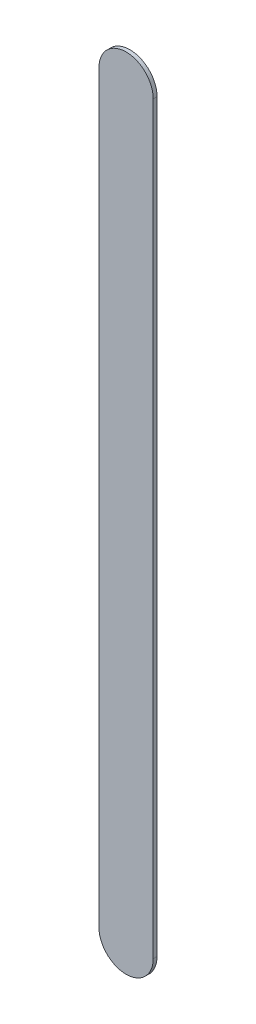
ISO-10303-21;
HEADER;
FILE_DESCRIPTION(('STEP AP214'),'2;1');
FILE_NAME('part.step','',(''),(''),'','','');
FILE_SCHEMA(('AUTOMOTIVE_DESIGN { 1 0 10303 214 1 1 1 1 }'));
ENDSEC;
DATA;
#1=APPLICATION_CONTEXT('core data for automotive mechanical design processes');
#2=APPLICATION_PROTOCOL_DEFINITION('international standard','automotive_design',2000,#1);
#3=PRODUCT_CONTEXT('',#1,'mechanical');
#4=PRODUCT('Part','Part','',(#3));
#5=PRODUCT_RELATED_PRODUCT_CATEGORY('part','',(#4));
#6=PRODUCT_DEFINITION_FORMATION('','',#4);
#7=PRODUCT_DEFINITION_CONTEXT('part definition',#1,'design');
#8=PRODUCT_DEFINITION('design','',#6,#7);
#9=PRODUCT_DEFINITION_SHAPE('','',#8);
#10=(LENGTH_UNIT() NAMED_UNIT(*) SI_UNIT(.MILLI.,.METRE.));
#11=(NAMED_UNIT(*) PLANE_ANGLE_UNIT() SI_UNIT($,.RADIAN.));
#12=(NAMED_UNIT(*) SI_UNIT($,.STERADIAN.) SOLID_ANGLE_UNIT());
#13=UNCERTAINTY_MEASURE_WITH_UNIT(LENGTH_MEASURE(1.E-05),#10,'distance_accuracy_value','');
#14=(GEOMETRIC_REPRESENTATION_CONTEXT(3) GLOBAL_UNCERTAINTY_ASSIGNED_CONTEXT((#13)) GLOBAL_UNIT_ASSIGNED_CONTEXT((#10,
#11,#12)) REPRESENTATION_CONTEXT('',''));
#15=CARTESIAN_POINT('',(0.,0.,0.));
#16=DIRECTION('',(0.,0.,1.));
#17=DIRECTION('',(1.,0.,0.));
#18=AXIS2_PLACEMENT_3D('',#15,#16,#17);
#19=CARTESIAN_POINT('',(163.572,-123.825,0.));
#20=DIRECTION('',(0.,0.,1.));
#21=DIRECTION('',(1.,0.,0.));
#22=AXIS2_PLACEMENT_3D('',#19,#20,#21);
#23=PLANE('',#22);
#24=DIRECTION('',(0.,1.,0.));
#25=VECTOR('',#24,1.);
#26=CARTESIAN_POINT('',(163.572,-123.825,0.));
#27=LINE('',#26,#25);
#28=CARTESIAN_POINT('',(163.572,-123.825,0.));
#29=VERTEX_POINT('',#28);
#30=CARTESIAN_POINT('',(163.572,-116.967,0.));
#31=VERTEX_POINT('',#30);
#32=EDGE_CURVE('E86',#29,#31,#27,.T.);
#33=ORIENTED_EDGE('',*,*,#32,.T.);
#34=CARTESIAN_POINT('',(163.322,-116.967,0.));
#35=DIRECTION('',(0.,0.,1.));
#36=DIRECTION('',(1.,0.,0.));
#37=AXIS2_PLACEMENT_3D('',#34,#35,#36);
#38=CIRCLE('',#37,0.25);
#39=CARTESIAN_POINT('',(163.072,-116.967,0.));
#40=VERTEX_POINT('',#39);
#41=EDGE_CURVE('E72',#31,#40,#38,.T.);
#42=ORIENTED_EDGE('',*,*,#41,.T.);
#43=DIRECTION('',(0.,-1.,0.));
#44=VECTOR('',#43,1.);
#45=CARTESIAN_POINT('',(163.072,-116.967,0.));
#46=LINE('',#45,#44);
#47=CARTESIAN_POINT('',(163.072,-123.825,0.));
#48=VERTEX_POINT('',#47);
#49=EDGE_CURVE('E107',#40,#48,#46,.T.);
#50=ORIENTED_EDGE('',*,*,#49,.T.);
#51=CARTESIAN_POINT('',(163.322,-123.825,0.));
#52=DIRECTION('',(0.,0.,1.));
#53=DIRECTION('',(-1.,0.,0.));
#54=AXIS2_PLACEMENT_3D('',#51,#52,#53);
#55=CIRCLE('',#54,0.25);
#56=EDGE_CURVE('E11',#48,#29,#55,.T.);
#57=ORIENTED_EDGE('',*,*,#56,.T.);
#58=EDGE_LOOP('',(#33,#42,#50,#57));
#59=FACE_BOUND('',#58,.T.);
#60=ADVANCED_FACE('F17',(#59),#23,.T.);
#61=CARTESIAN_POINT('',(163.572,-123.825,-0.035));
#62=DIRECTION('',(0.,0.,1.));
#63=DIRECTION('',(1.,0.,0.));
#64=AXIS2_PLACEMENT_3D('',#61,#62,#63);
#65=PLANE('',#64);
#66=CARTESIAN_POINT('',(163.322,-123.825,-0.035));
#67=DIRECTION('',(0.,0.,1.));
#68=DIRECTION('',(-1.,0.,0.));
#69=AXIS2_PLACEMENT_3D('',#66,#67,#68);
#70=CIRCLE('',#69,0.25);
#71=CARTESIAN_POINT('',(163.072,-123.825,-0.035));
#72=VERTEX_POINT('',#71);
#73=CARTESIAN_POINT('',(163.572,-123.825,-0.035));
#74=VERTEX_POINT('',#73);
#75=EDGE_CURVE('E21',#72,#74,#70,.T.);
#76=ORIENTED_EDGE('',*,*,#75,.F.);
#77=DIRECTION('',(0.,-1.,0.));
#78=VECTOR('',#77,1.);
#79=CARTESIAN_POINT('',(163.072,-116.967,-0.035));
#80=LINE('',#79,#78);
#81=CARTESIAN_POINT('',(163.072,-116.967,-0.035));
#82=VERTEX_POINT('',#81);
#83=EDGE_CURVE('E83',#82,#72,#80,.T.);
#84=ORIENTED_EDGE('',*,*,#83,.F.);
#85=CARTESIAN_POINT('',(163.322,-116.967,-0.035));
#86=DIRECTION('',(0.,0.,1.));
#87=DIRECTION('',(1.,0.,0.));
#88=AXIS2_PLACEMENT_3D('',#85,#86,#87);
#89=CIRCLE('',#88,0.25);
#90=CARTESIAN_POINT('',(163.572,-116.967,-0.035));
#91=VERTEX_POINT('',#90);
#92=EDGE_CURVE('E104',#91,#82,#89,.T.);
#93=ORIENTED_EDGE('',*,*,#92,.F.);
#94=DIRECTION('',(0.,1.,0.));
#95=VECTOR('',#94,1.);
#96=CARTESIAN_POINT('',(163.572,-123.825,-0.035));
#97=LINE('',#96,#95);
#98=EDGE_CURVE('E93',#74,#91,#97,.T.);
#99=ORIENTED_EDGE('',*,*,#98,.F.);
#100=EDGE_LOOP('',(#76,#84,#93,#99));
#101=FACE_BOUND('',#100,.T.);
#102=ADVANCED_FACE('F19',(#101),#65,.F.);
#103=CARTESIAN_POINT('',(163.322,-123.825,-0.035));
#104=DIRECTION('',(0.,0.,-1.));
#105=DIRECTION('',(-1.,0.,0.));
#106=AXIS2_PLACEMENT_3D('',#103,#104,#105);
#107=CYLINDRICAL_SURFACE('',#106,0.25);
#108=ORIENTED_EDGE('',*,*,#75,.T.);
#109=DIRECTION('',(0.,0.,1.));
#110=VECTOR('',#109,1.);
#111=CARTESIAN_POINT('',(163.572,-123.825,-0.035));
#112=LINE('',#111,#110);
#113=EDGE_CURVE('E90',#74,#29,#112,.T.);
#114=ORIENTED_EDGE('',*,*,#113,.T.);
#115=ORIENTED_EDGE('',*,*,#56,.F.);
#116=DIRECTION('',(0.,0.,1.));
#117=VECTOR('',#116,1.);
#118=CARTESIAN_POINT('',(163.072,-123.825,-0.035));
#119=LINE('',#118,#117);
#120=EDGE_CURVE('E109',#72,#48,#119,.T.);
#121=ORIENTED_EDGE('',*,*,#120,.F.);
#122=EDGE_LOOP('',(#108,#114,#115,#121));
#123=FACE_BOUND('',#122,.T.);
#124=ADVANCED_FACE('F126',(#123),#107,.T.);
#125=CARTESIAN_POINT('',(163.072,-116.967,-0.035));
#126=DIRECTION('',(1.,0.,0.));
#127=DIRECTION('',(0.,1.,0.));
#128=AXIS2_PLACEMENT_3D('',#125,#126,#127);
#129=PLANE('',#128);
#130=ORIENTED_EDGE('',*,*,#83,.T.);
#131=ORIENTED_EDGE('',*,*,#120,.T.);
#132=ORIENTED_EDGE('',*,*,#49,.F.);
#133=DIRECTION('',(0.,0.,1.));
#134=VECTOR('',#133,1.);
#135=CARTESIAN_POINT('',(163.072,-116.967,-0.035));
#136=LINE('',#135,#134);
#137=EDGE_CURVE('E80',#82,#40,#136,.T.);
#138=ORIENTED_EDGE('',*,*,#137,.F.);
#139=EDGE_LOOP('',(#130,#131,#132,#138));
#140=FACE_BOUND('',#139,.T.);
#141=ADVANCED_FACE('F124',(#140),#129,.F.);
#142=CARTESIAN_POINT('',(163.322,-116.967,-0.035));
#143=DIRECTION('',(0.,0.,-1.));
#144=DIRECTION('',(1.,0.,0.));
#145=AXIS2_PLACEMENT_3D('',#142,#143,#144);
#146=CYLINDRICAL_SURFACE('',#145,0.25);
#147=ORIENTED_EDGE('',*,*,#92,.T.);
#148=ORIENTED_EDGE('',*,*,#137,.T.);
#149=ORIENTED_EDGE('',*,*,#41,.F.);
#150=DIRECTION('',(0.,0.,1.));
#151=VECTOR('',#150,1.);
#152=CARTESIAN_POINT('',(163.572,-116.967,-0.035));
#153=LINE('',#152,#151);
#154=EDGE_CURVE('E77',#91,#31,#153,.T.);
#155=ORIENTED_EDGE('',*,*,#154,.F.);
#156=EDGE_LOOP('',(#147,#148,#149,#155));
#157=FACE_BOUND('',#156,.T.);
#158=ADVANCED_FACE('F75',(#157),#146,.T.);
#159=CARTESIAN_POINT('',(163.572,-123.825,-0.035));
#160=DIRECTION('',(-1.,0.,0.));
#161=DIRECTION('',(0.,0.,1.));
#162=AXIS2_PLACEMENT_3D('',#159,#160,#161);
#163=PLANE('',#162);
#164=ORIENTED_EDGE('',*,*,#98,.T.);
#165=ORIENTED_EDGE('',*,*,#154,.T.);
#166=ORIENTED_EDGE('',*,*,#32,.F.);
#167=ORIENTED_EDGE('',*,*,#113,.F.);
#168=EDGE_LOOP('',(#164,#165,#166,#167));
#169=FACE_BOUND('',#168,.T.);
#170=ADVANCED_FACE('F92',(#169),#163,.F.);
#171=CLOSED_SHELL('',(#60,#102,#124,#141,#158,#170));
#172=MANIFOLD_SOLID_BREP('B1',#171);
#173=ADVANCED_BREP_SHAPE_REPRESENTATION('',(#18,#172),#14);
#174=SHAPE_DEFINITION_REPRESENTATION(#9,#173);
ENDSEC;
END-ISO-10303-21;
